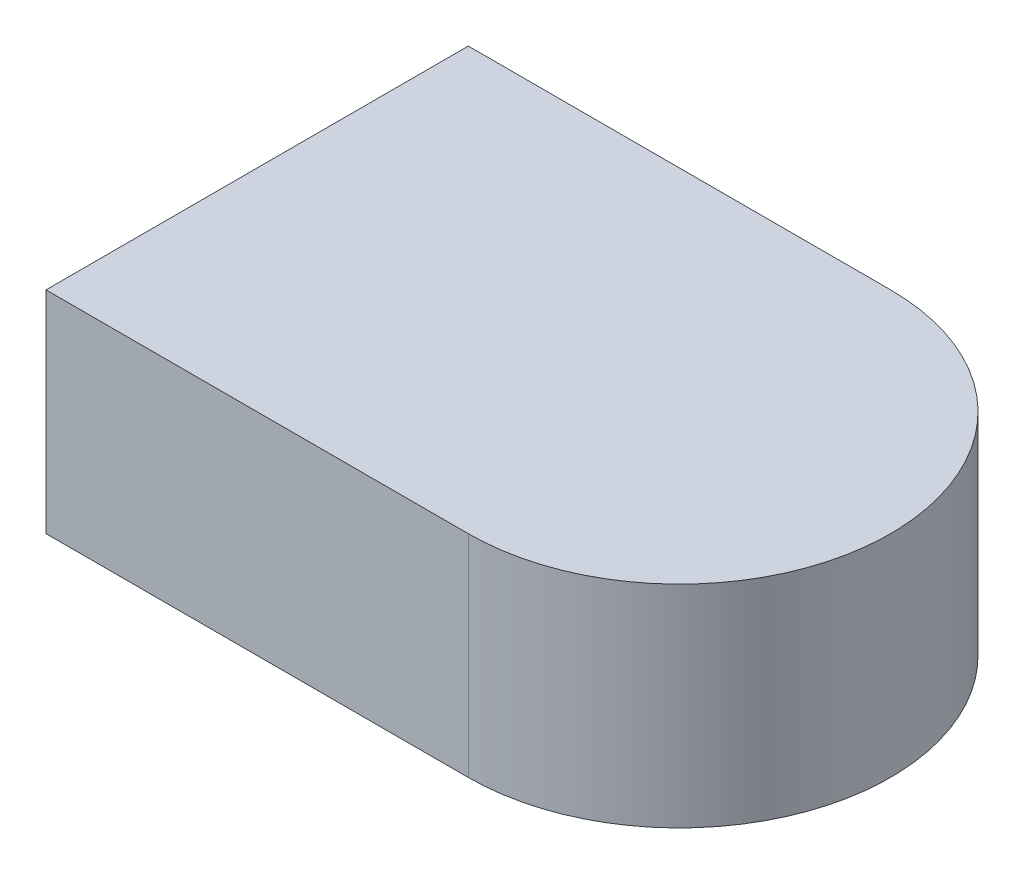
ISO-10303-21;
HEADER;
FILE_DESCRIPTION(('STEP AP214'),'2;1');
FILE_NAME('part.step','',(''),(''),'','','');
FILE_SCHEMA(('AUTOMOTIVE_DESIGN { 1 0 10303 214 1 1 1 1 }'));
ENDSEC;
DATA;
#1=APPLICATION_CONTEXT('core data for automotive mechanical design processes');
#2=APPLICATION_PROTOCOL_DEFINITION('international standard','automotive_design',2000,#1);
#3=PRODUCT_CONTEXT('',#1,'mechanical');
#4=PRODUCT('Part','Part','',(#3));
#5=PRODUCT_RELATED_PRODUCT_CATEGORY('part','',(#4));
#6=PRODUCT_DEFINITION_FORMATION('','',#4);
#7=PRODUCT_DEFINITION_CONTEXT('part definition',#1,'design');
#8=PRODUCT_DEFINITION('design','',#6,#7);
#9=PRODUCT_DEFINITION_SHAPE('','',#8);
#10=(LENGTH_UNIT() NAMED_UNIT(*) SI_UNIT(.MILLI.,.METRE.));
#11=(NAMED_UNIT(*) PLANE_ANGLE_UNIT() SI_UNIT($,.RADIAN.));
#12=(NAMED_UNIT(*) SI_UNIT($,.STERADIAN.) SOLID_ANGLE_UNIT());
#13=UNCERTAINTY_MEASURE_WITH_UNIT(LENGTH_MEASURE(1.E-05),#10,'distance_accuracy_value','');
#14=(GEOMETRIC_REPRESENTATION_CONTEXT(3) GLOBAL_UNCERTAINTY_ASSIGNED_CONTEXT((#13)) GLOBAL_UNIT_ASSIGNED_CONTEXT((#10,
#11,#12)) REPRESENTATION_CONTEXT('',''));
#15=CARTESIAN_POINT('',(0.,0.,0.));
#16=DIRECTION('',(0.,0.,1.));
#17=DIRECTION('',(1.,0.,0.));
#18=AXIS2_PLACEMENT_3D('',#15,#16,#17);
#19=CARTESIAN_POINT('',(0.,0.,0.));
#20=DIRECTION('',(0.,-1.,0.));
#21=DIRECTION('',(-1.,0.,0.));
#22=AXIS2_PLACEMENT_3D('',#19,#20,#21);
#23=PLANE('',#22);
#24=CARTESIAN_POINT('',(-1.05,0.,0.6));
#25=DIRECTION('',(0.,-1.,0.));
#26=DIRECTION('',(0.,0.,-1.));
#27=AXIS2_PLACEMENT_3D('',#24,#25,#26);
#28=CIRCLE('',#27,0.1);
#29=CARTESIAN_POINT('',(-1.05,0.,0.5));
#30=VERTEX_POINT('',#29);
#31=CARTESIAN_POINT('',(-1.05,0.,0.7));
#32=VERTEX_POINT('',#31);
#33=EDGE_CURVE('E11',#30,#32,#28,.T.);
#34=ORIENTED_EDGE('',*,*,#33,.T.);
#35=DIRECTION('',(-1.,0.,0.));
#36=VECTOR('',#35,1.);
#37=CARTESIAN_POINT('',(-1.05,0.,0.7));
#38=LINE('',#37,#36);
#39=CARTESIAN_POINT('',(-1.25,0.,0.7));
#40=VERTEX_POINT('',#39);
#41=EDGE_CURVE('E25',#32,#40,#38,.T.);
#42=ORIENTED_EDGE('',*,*,#41,.T.);
#43=DIRECTION('',(0.,0.,-1.));
#44=VECTOR('',#43,1.);
#45=CARTESIAN_POINT('',(-1.25,0.,0.7));
#46=LINE('',#45,#44);
#47=CARTESIAN_POINT('',(-1.25,0.,0.5));
#48=VERTEX_POINT('',#47);
#49=EDGE_CURVE('E73',#40,#48,#46,.T.);
#50=ORIENTED_EDGE('',*,*,#49,.T.);
#51=DIRECTION('',(1.,0.,0.));
#52=VECTOR('',#51,1.);
#53=CARTESIAN_POINT('',(-1.25,0.,0.5));
#54=LINE('',#53,#52);
#55=EDGE_CURVE('E99',#48,#30,#54,.T.);
#56=ORIENTED_EDGE('',*,*,#55,.T.);
#57=EDGE_LOOP('',(#34,#42,#50,#56));
#58=FACE_BOUND('',#57,.T.);
#59=ADVANCED_FACE('F17',(#58),#23,.T.);
#60=CARTESIAN_POINT('',(-1.25,0.,0.5));
#61=DIRECTION('',(0.,0.,1.));
#62=DIRECTION('',(1.,0.,0.));
#63=AXIS2_PLACEMENT_3D('',#60,#61,#62);
#64=PLANE('',#63);
#65=DIRECTION('',(0.,1.,0.));
#66=VECTOR('',#65,1.);
#67=CARTESIAN_POINT('',(-1.25,0.,0.5));
#68=LINE('',#67,#66);
#69=CARTESIAN_POINT('',(-1.25,0.1,0.5));
#70=VERTEX_POINT('',#69);
#71=EDGE_CURVE('E95',#48,#70,#68,.T.);
#72=ORIENTED_EDGE('',*,*,#71,.T.);
#73=DIRECTION('',(1.,0.,0.));
#74=VECTOR('',#73,1.);
#75=CARTESIAN_POINT('',(-1.25,0.1,0.5));
#76=LINE('',#75,#74);
#77=CARTESIAN_POINT('',(-1.05,0.1,0.5));
#78=VERTEX_POINT('',#77);
#79=EDGE_CURVE('E68',#70,#78,#76,.T.);
#80=ORIENTED_EDGE('',*,*,#79,.T.);
#81=DIRECTION('',(0.,1.,0.));
#82=VECTOR('',#81,1.);
#83=CARTESIAN_POINT('',(-1.05,0.,0.5));
#84=LINE('',#83,#82);
#85=EDGE_CURVE('E87',#30,#78,#84,.T.);
#86=ORIENTED_EDGE('',*,*,#85,.F.);
#87=ORIENTED_EDGE('',*,*,#55,.F.);
#88=EDGE_LOOP('',(#72,#80,#86,#87));
#89=FACE_BOUND('',#88,.T.);
#90=ADVANCED_FACE('F113',(#89),#64,.F.);
#91=CARTESIAN_POINT('',(-1.05,0.,0.6));
#92=DIRECTION('',(0.,-1.,0.));
#93=DIRECTION('',(-1.,0.,0.));
#94=AXIS2_PLACEMENT_3D('',#91,#92,#93);
#95=CYLINDRICAL_SURFACE('',#94,0.1);
#96=ORIENTED_EDGE('',*,*,#85,.T.);
#97=CARTESIAN_POINT('',(-1.05,0.1,0.6));
#98=DIRECTION('',(0.,-1.,0.));
#99=DIRECTION('',(0.,0.,-1.));
#100=AXIS2_PLACEMENT_3D('',#97,#98,#99);
#101=CIRCLE('',#100,0.1);
#102=CARTESIAN_POINT('',(-1.05,0.1,0.7));
#103=VERTEX_POINT('',#102);
#104=EDGE_CURVE('E83',#78,#103,#101,.T.);
#105=ORIENTED_EDGE('',*,*,#104,.T.);
#106=DIRECTION('',(0.,1.,0.));
#107=VECTOR('',#106,1.);
#108=CARTESIAN_POINT('',(-1.05,0.,0.7));
#109=LINE('',#108,#107);
#110=EDGE_CURVE('E60',#32,#103,#109,.T.);
#111=ORIENTED_EDGE('',*,*,#110,.F.);
#112=ORIENTED_EDGE('',*,*,#33,.F.);
#113=EDGE_LOOP('',(#96,#105,#111,#112));
#114=FACE_BOUND('',#113,.T.);
#115=ADVANCED_FACE('F115',(#114),#95,.T.);
#116=CARTESIAN_POINT('',(-1.05,0.,0.7));
#117=DIRECTION('',(0.,0.,-1.));
#118=DIRECTION('',(-1.,0.,0.));
#119=AXIS2_PLACEMENT_3D('',#116,#117,#118);
#120=PLANE('',#119);
#121=ORIENTED_EDGE('',*,*,#110,.T.);
#122=DIRECTION('',(-1.,0.,0.));
#123=VECTOR('',#122,1.);
#124=CARTESIAN_POINT('',(-1.05,0.1,0.7));
#125=LINE('',#124,#123);
#126=CARTESIAN_POINT('',(-1.25,0.1,0.7));
#127=VERTEX_POINT('',#126);
#128=EDGE_CURVE('E53',#103,#127,#125,.T.);
#129=ORIENTED_EDGE('',*,*,#128,.T.);
#130=DIRECTION('',(0.,1.,0.));
#131=VECTOR('',#130,1.);
#132=CARTESIAN_POINT('',(-1.25,0.,0.7));
#133=LINE('',#132,#131);
#134=EDGE_CURVE('E57',#40,#127,#133,.T.);
#135=ORIENTED_EDGE('',*,*,#134,.F.);
#136=ORIENTED_EDGE('',*,*,#41,.F.);
#137=EDGE_LOOP('',(#121,#129,#135,#136));
#138=FACE_BOUND('',#137,.T.);
#139=ADVANCED_FACE('F55',(#138),#120,.F.);
#140=CARTESIAN_POINT('',(-1.25,0.,0.7));
#141=DIRECTION('',(1.,0.,0.));
#142=DIRECTION('',(0.,0.,-1.));
#143=AXIS2_PLACEMENT_3D('',#140,#141,#142);
#144=PLANE('',#143);
#145=ORIENTED_EDGE('',*,*,#134,.T.);
#146=DIRECTION('',(0.,0.,-1.));
#147=VECTOR('',#146,1.);
#148=CARTESIAN_POINT('',(-1.25,0.1,0.7));
#149=LINE('',#148,#147);
#150=EDGE_CURVE('E66',#127,#70,#149,.T.);
#151=ORIENTED_EDGE('',*,*,#150,.T.);
#152=ORIENTED_EDGE('',*,*,#71,.F.);
#153=ORIENTED_EDGE('',*,*,#49,.F.);
#154=EDGE_LOOP('',(#145,#151,#152,#153));
#155=FACE_BOUND('',#154,.T.);
#156=ADVANCED_FACE('F72',(#155),#144,.F.);
#157=CARTESIAN_POINT('',(0.,0.1,0.));
#158=DIRECTION('',(0.,-1.,0.));
#159=DIRECTION('',(-1.,0.,0.));
#160=AXIS2_PLACEMENT_3D('',#157,#158,#159);
#161=PLANE('',#160);
#162=ORIENTED_EDGE('',*,*,#150,.F.);
#163=ORIENTED_EDGE('',*,*,#128,.F.);
#164=ORIENTED_EDGE('',*,*,#104,.F.);
#165=ORIENTED_EDGE('',*,*,#79,.F.);
#166=EDGE_LOOP('',(#162,#163,#164,#165));
#167=FACE_BOUND('',#166,.T.);
#168=ADVANCED_FACE('F67',(#167),#161,.F.);
#169=CLOSED_SHELL('',(#59,#90,#115,#139,#156,#168));
#170=MANIFOLD_SOLID_BREP('B1',#169);
#171=ADVANCED_BREP_SHAPE_REPRESENTATION('',(#18,#170),#14);
#172=SHAPE_DEFINITION_REPRESENTATION(#9,#171);
ENDSEC;
END-ISO-10303-21;
